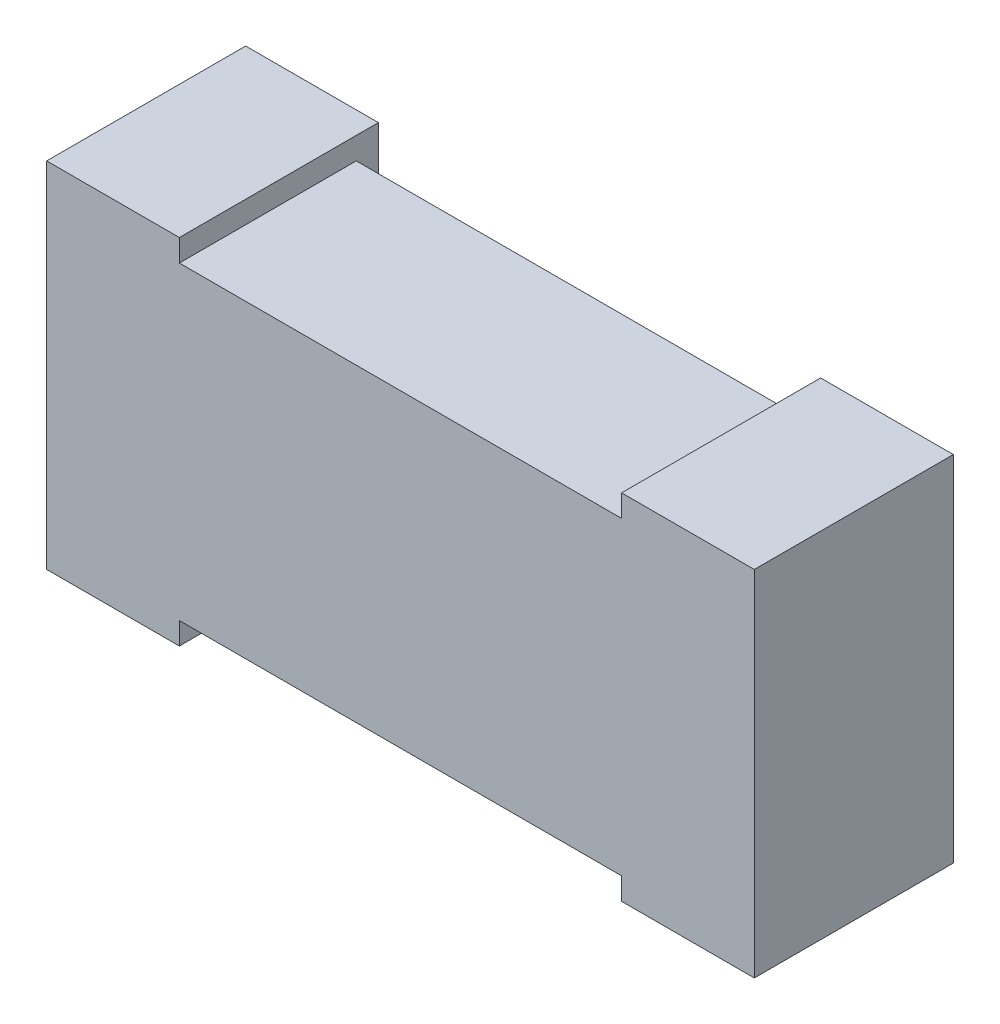
ISO-10303-21;
HEADER;
FILE_DESCRIPTION(('STEP AP214'),'2;1');
FILE_NAME('part.step','',(''),(''),'','','');
FILE_SCHEMA(('AUTOMOTIVE_DESIGN { 1 0 10303 214 1 1 1 1 }'));
ENDSEC;
DATA;
#1=APPLICATION_CONTEXT('core data for automotive mechanical design processes');
#2=APPLICATION_PROTOCOL_DEFINITION('international standard','automotive_design',2000,#1);
#3=PRODUCT_CONTEXT('',#1,'mechanical');
#4=PRODUCT('Part','Part','',(#3));
#5=PRODUCT_RELATED_PRODUCT_CATEGORY('part','',(#4));
#6=PRODUCT_DEFINITION_FORMATION('','',#4);
#7=PRODUCT_DEFINITION_CONTEXT('part definition',#1,'design');
#8=PRODUCT_DEFINITION('design','',#6,#7);
#9=PRODUCT_DEFINITION_SHAPE('','',#8);
#10=(LENGTH_UNIT() NAMED_UNIT(*) SI_UNIT(.MILLI.,.METRE.));
#11=(NAMED_UNIT(*) PLANE_ANGLE_UNIT() SI_UNIT($,.RADIAN.));
#12=(NAMED_UNIT(*) SI_UNIT($,.STERADIAN.) SOLID_ANGLE_UNIT());
#13=UNCERTAINTY_MEASURE_WITH_UNIT(LENGTH_MEASURE(1.E-05),#10,'distance_accuracy_value','');
#14=(GEOMETRIC_REPRESENTATION_CONTEXT(3) GLOBAL_UNCERTAINTY_ASSIGNED_CONTEXT((#13)) GLOBAL_UNIT_ASSIGNED_CONTEXT((#10,
#11,#12)) REPRESENTATION_CONTEXT('',''));
#15=CARTESIAN_POINT('',(0.,0.,0.));
#16=DIRECTION('',(0.,0.,1.));
#17=DIRECTION('',(1.,0.,0.));
#18=AXIS2_PLACEMENT_3D('',#15,#16,#17);
#19=CARTESIAN_POINT('',(-1.001,1.799,-7.45));
#20=DIRECTION('',(0.,0.,-1.));
#21=DIRECTION('',(0.,1.,0.));
#22=AXIS2_PLACEMENT_3D('',#19,#20,#21);
#23=PLANE('',#22);
#24=DIRECTION('',(1.,0.,0.));
#25=VECTOR('',#24,1.);
#26=CARTESIAN_POINT('',(-0.85,1.8,-7.45));
#27=LINE('',#26,#25);
#28=CARTESIAN_POINT('',(-1.,1.8,-7.45));
#29=VERTEX_POINT('',#28);
#30=CARTESIAN_POINT('',(-0.7,1.8,-7.45));
#31=VERTEX_POINT('',#30);
#32=EDGE_CURVE('E110',#29,#31,#27,.T.);
#33=ORIENTED_EDGE('',*,*,#32,.F.);
#34=DIRECTION('',(0.,-1.,0.));
#35=VECTOR('',#34,1.);
#36=CARTESIAN_POINT('',(-1.,2.2,-7.45));
#37=LINE('',#36,#35);
#38=CARTESIAN_POINT('',(-1.,2.6,-7.45));
#39=VERTEX_POINT('',#38);
#40=EDGE_CURVE('E104',#39,#29,#37,.T.);
#41=ORIENTED_EDGE('',*,*,#40,.F.);
#42=DIRECTION('',(-1.,0.,0.));
#43=VECTOR('',#42,1.);
#44=CARTESIAN_POINT('',(-0.85,2.6,-7.45));
#45=LINE('',#44,#43);
#46=CARTESIAN_POINT('',(-0.7,2.6,-7.45));
#47=VERTEX_POINT('',#46);
#48=EDGE_CURVE('E21',#47,#39,#45,.T.);
#49=ORIENTED_EDGE('',*,*,#48,.F.);
#50=DIRECTION('',(0.,1.,0.));
#51=VECTOR('',#50,1.);
#52=CARTESIAN_POINT('',(-0.7,2.2,-7.45));
#53=LINE('',#52,#51);
#54=EDGE_CURVE('E131',#31,#47,#53,.T.);
#55=ORIENTED_EDGE('',*,*,#54,.F.);
#56=EDGE_LOOP('',(#33,#41,#49,#55));
#57=FACE_BOUND('',#56,.T.);
#58=ADVANCED_FACE('F17',(#57),#23,.T.);
#59=CARTESIAN_POINT('',(-1.001,2.6,-6.999));
#60=DIRECTION('',(0.,1.,0.));
#61=DIRECTION('',(1.,0.,0.));
#62=AXIS2_PLACEMENT_3D('',#59,#60,#61);
#63=PLANE('',#62);
#64=DIRECTION('',(0.,0.,1.));
#65=VECTOR('',#64,1.);
#66=CARTESIAN_POINT('',(-0.7,2.6,-7.225));
#67=LINE('',#66,#65);
#68=CARTESIAN_POINT('',(-0.7,2.6,-7.));
#69=VERTEX_POINT('',#68);
#70=EDGE_CURVE('E117',#47,#69,#67,.T.);
#71=ORIENTED_EDGE('',*,*,#70,.F.);
#72=ORIENTED_EDGE('',*,*,#48,.T.);
#73=DIRECTION('',(0.,0.,-1.));
#74=VECTOR('',#73,1.);
#75=CARTESIAN_POINT('',(-1.,2.6,-7.225));
#76=LINE('',#75,#74);
#77=CARTESIAN_POINT('',(-1.,2.6,-7.));
#78=VERTEX_POINT('',#77);
#79=EDGE_CURVE('E112',#78,#39,#76,.T.);
#80=ORIENTED_EDGE('',*,*,#79,.F.);
#81=DIRECTION('',(-1.,0.,0.));
#82=VECTOR('',#81,1.);
#83=CARTESIAN_POINT('',(-0.2,2.6,-7.));
#84=LINE('',#83,#82);
#85=EDGE_CURVE('E155',#69,#78,#84,.T.);
#86=ORIENTED_EDGE('',*,*,#85,.F.);
#87=EDGE_LOOP('',(#71,#72,#80,#86));
#88=FACE_BOUND('',#87,.T.);
#89=ADVANCED_FACE('F114',(#88),#63,.T.);
#90=CARTESIAN_POINT('',(-1.,1.799,-6.999));
#91=DIRECTION('',(-1.,0.,0.));
#92=DIRECTION('',(0.,1.,0.));
#93=AXIS2_PLACEMENT_3D('',#90,#91,#92);
#94=PLANE('',#93);
#95=DIRECTION('',(0.,-1.,0.));
#96=VECTOR('',#95,1.);
#97=CARTESIAN_POINT('',(-1.,2.2,-7.));
#98=LINE('',#97,#96);
#99=CARTESIAN_POINT('',(-1.,1.8,-7.));
#100=VERTEX_POINT('',#99);
#101=EDGE_CURVE('E121',#78,#100,#98,.T.);
#102=ORIENTED_EDGE('',*,*,#101,.F.);
#103=ORIENTED_EDGE('',*,*,#79,.T.);
#104=ORIENTED_EDGE('',*,*,#40,.T.);
#105=DIRECTION('',(0.,0.,-1.));
#106=VECTOR('',#105,1.);
#107=CARTESIAN_POINT('',(-1.,1.8,-7.225));
#108=LINE('',#107,#106);
#109=EDGE_CURVE('E123',#100,#29,#108,.T.);
#110=ORIENTED_EDGE('',*,*,#109,.F.);
#111=EDGE_LOOP('',(#102,#103,#104,#110));
#112=FACE_BOUND('',#111,.T.);
#113=ADVANCED_FACE('F119',(#112),#94,.T.);
#114=CARTESIAN_POINT('',(-0.698999999999999,1.8,-6.999));
#115=DIRECTION('',(0.,-1.,0.));
#116=DIRECTION('',(-1.,0.,0.));
#117=AXIS2_PLACEMENT_3D('',#114,#115,#116);
#118=PLANE('',#117);
#119=ORIENTED_EDGE('',*,*,#109,.T.);
#120=ORIENTED_EDGE('',*,*,#32,.T.);
#121=DIRECTION('',(0.,0.,-1.));
#122=VECTOR('',#121,1.);
#123=CARTESIAN_POINT('',(-0.7,1.8,-7.225));
#124=LINE('',#123,#122);
#125=CARTESIAN_POINT('',(-0.7,1.8,-7.));
#126=VERTEX_POINT('',#125);
#127=EDGE_CURVE('E128',#126,#31,#124,.T.);
#128=ORIENTED_EDGE('',*,*,#127,.F.);
#129=DIRECTION('',(1.,0.,0.));
#130=VECTOR('',#129,1.);
#131=CARTESIAN_POINT('',(-0.2,1.8,-7.));
#132=LINE('',#131,#130);
#133=EDGE_CURVE('E158',#100,#126,#132,.T.);
#134=ORIENTED_EDGE('',*,*,#133,.F.);
#135=EDGE_LOOP('',(#119,#120,#128,#134));
#136=FACE_BOUND('',#135,.T.);
#137=ADVANCED_FACE('F228',(#136),#118,.T.);
#138=CARTESIAN_POINT('',(-0.7,2.601,-6.999));
#139=DIRECTION('',(1.,0.,0.));
#140=DIRECTION('',(0.,-1.,0.));
#141=AXIS2_PLACEMENT_3D('',#138,#139,#140);
#142=PLANE('',#141);
#143=ORIENTED_EDGE('',*,*,#70,.T.);
#144=DIRECTION('',(0.,1.,0.));
#145=VECTOR('',#144,1.);
#146=CARTESIAN_POINT('',(-0.7,2.2,-7.));
#147=LINE('',#146,#145);
#148=CARTESIAN_POINT('',(-0.7,2.55,-7.));
#149=VERTEX_POINT('',#148);
#150=EDGE_CURVE('E152',#149,#69,#147,.T.);
#151=ORIENTED_EDGE('',*,*,#150,.F.);
#152=DIRECTION('',(0.,0.,1.));
#153=VECTOR('',#152,1.);
#154=CARTESIAN_POINT('',(-0.7,2.55,-7.2));
#155=LINE('',#154,#153);
#156=CARTESIAN_POINT('',(-0.7,2.55,-7.4));
#157=VERTEX_POINT('',#156);
#158=EDGE_CURVE('E142',#157,#149,#155,.T.);
#159=ORIENTED_EDGE('',*,*,#158,.F.);
#160=DIRECTION('',(0.,1.,0.));
#161=VECTOR('',#160,1.);
#162=CARTESIAN_POINT('',(-0.7,2.2,-7.4));
#163=LINE('',#162,#161);
#164=CARTESIAN_POINT('',(-0.7,1.85,-7.4));
#165=VERTEX_POINT('',#164);
#166=EDGE_CURVE('E139',#165,#157,#163,.T.);
#167=ORIENTED_EDGE('',*,*,#166,.F.);
#168=DIRECTION('',(0.,0.,-1.));
#169=VECTOR('',#168,1.);
#170=CARTESIAN_POINT('',(-0.7,1.85,-7.2));
#171=LINE('',#170,#169);
#172=CARTESIAN_POINT('',(-0.7,1.85,-7.));
#173=VERTEX_POINT('',#172);
#174=EDGE_CURVE('E134',#173,#165,#171,.T.);
#175=ORIENTED_EDGE('',*,*,#174,.F.);
#176=DIRECTION('',(0.,1.,0.));
#177=VECTOR('',#176,1.);
#178=CARTESIAN_POINT('',(-0.7,2.2,-7.));
#179=LINE('',#178,#177);
#180=EDGE_CURVE('E161',#126,#173,#179,.T.);
#181=ORIENTED_EDGE('',*,*,#180,.F.);
#182=ORIENTED_EDGE('',*,*,#127,.T.);
#183=ORIENTED_EDGE('',*,*,#54,.T.);
#184=EDGE_LOOP('',(#143,#151,#159,#167,#175,#181,#182,#183));
#185=FACE_BOUND('',#184,.T.);
#186=ADVANCED_FACE('F224',(#185),#142,.T.);
#187=CARTESIAN_POINT('',(0.301,1.85,-6.999));
#188=DIRECTION('',(0.,-1.,0.));
#189=DIRECTION('',(-1.,0.,0.));
#190=AXIS2_PLACEMENT_3D('',#187,#188,#189);
#191=PLANE('',#190);
#192=ORIENTED_EDGE('',*,*,#174,.T.);
#193=DIRECTION('',(-1.,0.,0.));
#194=VECTOR('',#193,1.);
#195=CARTESIAN_POINT('',(-0.2,1.85,-7.4));
#196=LINE('',#195,#194);
#197=CARTESIAN_POINT('',(0.3,1.85,-7.4));
#198=VERTEX_POINT('',#197);
#199=EDGE_CURVE('E136',#198,#165,#196,.T.);
#200=ORIENTED_EDGE('',*,*,#199,.F.);
#201=DIRECTION('',(0.,0.,-1.));
#202=VECTOR('',#201,1.);
#203=CARTESIAN_POINT('',(0.3,1.85,-7.225));
#204=LINE('',#203,#202);
#205=CARTESIAN_POINT('',(0.3,1.85,-7.));
#206=VERTEX_POINT('',#205);
#207=EDGE_CURVE('E169',#206,#198,#204,.T.);
#208=ORIENTED_EDGE('',*,*,#207,.F.);
#209=DIRECTION('',(1.,0.,0.));
#210=VECTOR('',#209,1.);
#211=CARTESIAN_POINT('',(-0.2,1.85,-7.));
#212=LINE('',#211,#210);
#213=EDGE_CURVE('E147',#173,#206,#212,.T.);
#214=ORIENTED_EDGE('',*,*,#213,.F.);
#215=EDGE_LOOP('',(#192,#200,#208,#214));
#216=FACE_BOUND('',#215,.T.);
#217=ADVANCED_FACE('F232',(#216),#191,.T.);
#218=CARTESIAN_POINT('',(-0.701,1.849,-7.4));
#219=DIRECTION('',(0.,0.,-1.));
#220=DIRECTION('',(0.,1.,0.));
#221=AXIS2_PLACEMENT_3D('',#218,#219,#220);
#222=PLANE('',#221);
#223=ORIENTED_EDGE('',*,*,#199,.T.);
#224=ORIENTED_EDGE('',*,*,#166,.T.);
#225=DIRECTION('',(-1.,0.,0.));
#226=VECTOR('',#225,1.);
#227=CARTESIAN_POINT('',(-0.2,2.55,-7.4));
#228=LINE('',#227,#226);
#229=CARTESIAN_POINT('',(0.3,2.55,-7.4));
#230=VERTEX_POINT('',#229);
#231=EDGE_CURVE('E144',#230,#157,#228,.T.);
#232=ORIENTED_EDGE('',*,*,#231,.F.);
#233=DIRECTION('',(0.,1.,0.));
#234=VECTOR('',#233,1.);
#235=CARTESIAN_POINT('',(0.3,2.2,-7.4));
#236=LINE('',#235,#234);
#237=EDGE_CURVE('E172',#198,#230,#236,.T.);
#238=ORIENTED_EDGE('',*,*,#237,.F.);
#239=EDGE_LOOP('',(#223,#224,#232,#238));
#240=FACE_BOUND('',#239,.T.);
#241=ADVANCED_FACE('F235',(#240),#222,.T.);
#242=CARTESIAN_POINT('',(-0.701,2.55,-6.999));
#243=DIRECTION('',(0.,1.,0.));
#244=DIRECTION('',(1.,0.,0.));
#245=AXIS2_PLACEMENT_3D('',#242,#243,#244);
#246=PLANE('',#245);
#247=DIRECTION('',(0.,0.,1.));
#248=VECTOR('',#247,1.);
#249=CARTESIAN_POINT('',(0.3,2.55,-7.225));
#250=LINE('',#249,#248);
#251=CARTESIAN_POINT('',(0.3,2.55,-7.));
#252=VERTEX_POINT('',#251);
#253=EDGE_CURVE('E175',#230,#252,#250,.T.);
#254=ORIENTED_EDGE('',*,*,#253,.F.);
#255=ORIENTED_EDGE('',*,*,#231,.T.);
#256=ORIENTED_EDGE('',*,*,#158,.T.);
#257=DIRECTION('',(-1.,0.,0.));
#258=VECTOR('',#257,1.);
#259=CARTESIAN_POINT('',(-0.2,2.55,-7.));
#260=LINE('',#259,#258);
#261=EDGE_CURVE('E149',#252,#149,#260,.T.);
#262=ORIENTED_EDGE('',*,*,#261,.F.);
#263=EDGE_LOOP('',(#254,#255,#256,#262));
#264=FACE_BOUND('',#263,.T.);
#265=ADVANCED_FACE('F221',(#264),#246,.T.);
#266=CARTESIAN_POINT('',(-1.001,2.601,-7.));
#267=DIRECTION('',(0.,0.,1.));
#268=DIRECTION('',(0.,-1.,0.));
#269=AXIS2_PLACEMENT_3D('',#266,#267,#268);
#270=PLANE('',#269);
#271=ORIENTED_EDGE('',*,*,#133,.T.);
#272=ORIENTED_EDGE('',*,*,#180,.T.);
#273=ORIENTED_EDGE('',*,*,#213,.T.);
#274=DIRECTION('',(0.,1.,0.));
#275=VECTOR('',#274,1.);
#276=CARTESIAN_POINT('',(0.3,2.2,-7.));
#277=LINE('',#276,#275);
#278=CARTESIAN_POINT('',(0.3,1.8,-7.));
#279=VERTEX_POINT('',#278);
#280=EDGE_CURVE('E166',#279,#206,#277,.T.);
#281=ORIENTED_EDGE('',*,*,#280,.F.);
#282=DIRECTION('',(-1.,0.,0.));
#283=VECTOR('',#282,1.);
#284=CARTESIAN_POINT('',(0.45,1.8,-7.));
#285=LINE('',#284,#283);
#286=CARTESIAN_POINT('',(0.6,1.8,-7.));
#287=VERTEX_POINT('',#286);
#288=EDGE_CURVE('E192',#287,#279,#285,.T.);
#289=ORIENTED_EDGE('',*,*,#288,.F.);
#290=DIRECTION('',(0.,-1.,0.));
#291=VECTOR('',#290,1.);
#292=CARTESIAN_POINT('',(0.6,2.2,-7.));
#293=LINE('',#292,#291);
#294=CARTESIAN_POINT('',(0.6,2.6,-7.));
#295=VERTEX_POINT('',#294);
#296=EDGE_CURVE('E186',#295,#287,#293,.T.);
#297=ORIENTED_EDGE('',*,*,#296,.F.);
#298=DIRECTION('',(1.,0.,0.));
#299=VECTOR('',#298,1.);
#300=CARTESIAN_POINT('',(0.45,2.6,-7.));
#301=LINE('',#300,#299);
#302=CARTESIAN_POINT('',(0.3,2.6,-7.));
#303=VERTEX_POINT('',#302);
#304=EDGE_CURVE('E181',#303,#295,#301,.T.);
#305=ORIENTED_EDGE('',*,*,#304,.F.);
#306=DIRECTION('',(0.,1.,0.));
#307=VECTOR('',#306,1.);
#308=CARTESIAN_POINT('',(0.3,2.2,-7.));
#309=LINE('',#308,#307);
#310=EDGE_CURVE('E164',#252,#303,#309,.T.);
#311=ORIENTED_EDGE('',*,*,#310,.F.);
#312=ORIENTED_EDGE('',*,*,#261,.T.);
#313=ORIENTED_EDGE('',*,*,#150,.T.);
#314=ORIENTED_EDGE('',*,*,#85,.T.);
#315=ORIENTED_EDGE('',*,*,#101,.T.);
#316=EDGE_LOOP('',(#271,#272,#273,#281,#289,#297,#305,#311,#312,#313,#314,#315));
#317=FACE_BOUND('',#316,.T.);
#318=ADVANCED_FACE('F212',(#317),#270,.T.);
#319=CARTESIAN_POINT('',(0.3,1.799,-6.999));
#320=DIRECTION('',(-1.,0.,0.));
#321=DIRECTION('',(0.,1.,0.));
#322=AXIS2_PLACEMENT_3D('',#319,#320,#321);
#323=PLANE('',#322);
#324=ORIENTED_EDGE('',*,*,#237,.T.);
#325=ORIENTED_EDGE('',*,*,#253,.T.);
#326=ORIENTED_EDGE('',*,*,#310,.T.);
#327=DIRECTION('',(0.,0.,1.));
#328=VECTOR('',#327,1.);
#329=CARTESIAN_POINT('',(0.3,2.6,-7.225));
#330=LINE('',#329,#328);
#331=CARTESIAN_POINT('',(0.3,2.6,-7.45));
#332=VERTEX_POINT('',#331);
#333=EDGE_CURVE('E178',#332,#303,#330,.T.);
#334=ORIENTED_EDGE('',*,*,#333,.F.);
#335=DIRECTION('',(0.,1.,0.));
#336=VECTOR('',#335,1.);
#337=CARTESIAN_POINT('',(0.3,2.2,-7.45));
#338=LINE('',#337,#336);
#339=CARTESIAN_POINT('',(0.3,1.8,-7.45));
#340=VERTEX_POINT('',#339);
#341=EDGE_CURVE('E195',#340,#332,#338,.T.);
#342=ORIENTED_EDGE('',*,*,#341,.F.);
#343=DIRECTION('',(0.,0.,-1.));
#344=VECTOR('',#343,1.);
#345=CARTESIAN_POINT('',(0.3,1.8,-7.225));
#346=LINE('',#345,#344);
#347=EDGE_CURVE('E188',#279,#340,#346,.T.);
#348=ORIENTED_EDGE('',*,*,#347,.F.);
#349=ORIENTED_EDGE('',*,*,#280,.T.);
#350=ORIENTED_EDGE('',*,*,#207,.T.);
#351=EDGE_LOOP('',(#324,#325,#326,#334,#342,#348,#349,#350));
#352=FACE_BOUND('',#351,.T.);
#353=ADVANCED_FACE('F217',(#352),#323,.T.);
#354=CARTESIAN_POINT('',(0.299,2.6,-6.999));
#355=DIRECTION('',(0.,1.,0.));
#356=DIRECTION('',(1.,0.,0.));
#357=AXIS2_PLACEMENT_3D('',#354,#355,#356);
#358=PLANE('',#357);
#359=DIRECTION('',(0.,0.,1.));
#360=VECTOR('',#359,1.);
#361=CARTESIAN_POINT('',(0.6,2.6,-7.225));
#362=LINE('',#361,#360);
#363=CARTESIAN_POINT('',(0.6,2.6,-7.45));
#364=VERTEX_POINT('',#363);
#365=EDGE_CURVE('E183',#364,#295,#362,.T.);
#366=ORIENTED_EDGE('',*,*,#365,.F.);
#367=DIRECTION('',(1.,0.,0.));
#368=VECTOR('',#367,1.);
#369=CARTESIAN_POINT('',(0.45,2.6,-7.45));
#370=LINE('',#369,#368);
#371=EDGE_CURVE('E198',#332,#364,#370,.T.);
#372=ORIENTED_EDGE('',*,*,#371,.F.);
#373=ORIENTED_EDGE('',*,*,#333,.T.);
#374=ORIENTED_EDGE('',*,*,#304,.T.);
#375=EDGE_LOOP('',(#366,#372,#373,#374));
#376=FACE_BOUND('',#375,.T.);
#377=ADVANCED_FACE('F208',(#376),#358,.T.);
#378=CARTESIAN_POINT('',(0.6,2.601,-6.999));
#379=DIRECTION('',(1.,0.,0.));
#380=DIRECTION('',(0.,-1.,0.));
#381=AXIS2_PLACEMENT_3D('',#378,#379,#380);
#382=PLANE('',#381);
#383=DIRECTION('',(0.,0.,1.));
#384=VECTOR('',#383,1.);
#385=CARTESIAN_POINT('',(0.6,1.8,-7.225));
#386=LINE('',#385,#384);
#387=CARTESIAN_POINT('',(0.6,1.8,-7.45));
#388=VERTEX_POINT('',#387);
#389=EDGE_CURVE('E36',#388,#287,#386,.T.);
#390=ORIENTED_EDGE('',*,*,#389,.F.);
#391=DIRECTION('',(0.,-1.,0.));
#392=VECTOR('',#391,1.);
#393=CARTESIAN_POINT('',(0.6,2.2,-7.45));
#394=LINE('',#393,#392);
#395=EDGE_CURVE('E27',#364,#388,#394,.T.);
#396=ORIENTED_EDGE('',*,*,#395,.F.);
#397=ORIENTED_EDGE('',*,*,#365,.T.);
#398=ORIENTED_EDGE('',*,*,#296,.T.);
#399=EDGE_LOOP('',(#390,#396,#397,#398));
#400=FACE_BOUND('',#399,.T.);
#401=ADVANCED_FACE('F204',(#400),#382,.T.);
#402=CARTESIAN_POINT('',(0.601,1.8,-6.999));
#403=DIRECTION('',(0.,-1.,0.));
#404=DIRECTION('',(-1.,0.,0.));
#405=AXIS2_PLACEMENT_3D('',#402,#403,#404);
#406=PLANE('',#405);
#407=ORIENTED_EDGE('',*,*,#389,.T.);
#408=ORIENTED_EDGE('',*,*,#288,.T.);
#409=ORIENTED_EDGE('',*,*,#347,.T.);
#410=DIRECTION('',(-1.,0.,0.));
#411=VECTOR('',#410,1.);
#412=CARTESIAN_POINT('',(0.45,1.8,-7.45));
#413=LINE('',#412,#411);
#414=EDGE_CURVE('E11',#388,#340,#413,.T.);
#415=ORIENTED_EDGE('',*,*,#414,.F.);
#416=EDGE_LOOP('',(#407,#408,#409,#415));
#417=FACE_BOUND('',#416,.T.);
#418=ADVANCED_FACE('F215',(#417),#406,.T.);
#419=CARTESIAN_POINT('',(0.299,1.799,-7.45));
#420=DIRECTION('',(0.,0.,-1.));
#421=DIRECTION('',(0.,1.,0.));
#422=AXIS2_PLACEMENT_3D('',#419,#420,#421);
#423=PLANE('',#422);
#424=ORIENTED_EDGE('',*,*,#395,.T.);
#425=ORIENTED_EDGE('',*,*,#414,.T.);
#426=ORIENTED_EDGE('',*,*,#341,.T.);
#427=ORIENTED_EDGE('',*,*,#371,.T.);
#428=EDGE_LOOP('',(#424,#425,#426,#427));
#429=FACE_BOUND('',#428,.T.);
#430=ADVANCED_FACE('F19',(#429),#423,.T.);
#431=CLOSED_SHELL('',(#58,#89,#113,#137,#186,#217,#241,#265,#318,#353,#377,#401,#418,#430));
#432=MANIFOLD_SOLID_BREP('B1',#431);
#433=ADVANCED_BREP_SHAPE_REPRESENTATION('',(#18,#432),#14);
#434=SHAPE_DEFINITION_REPRESENTATION(#9,#433);
ENDSEC;
END-ISO-10303-21;
